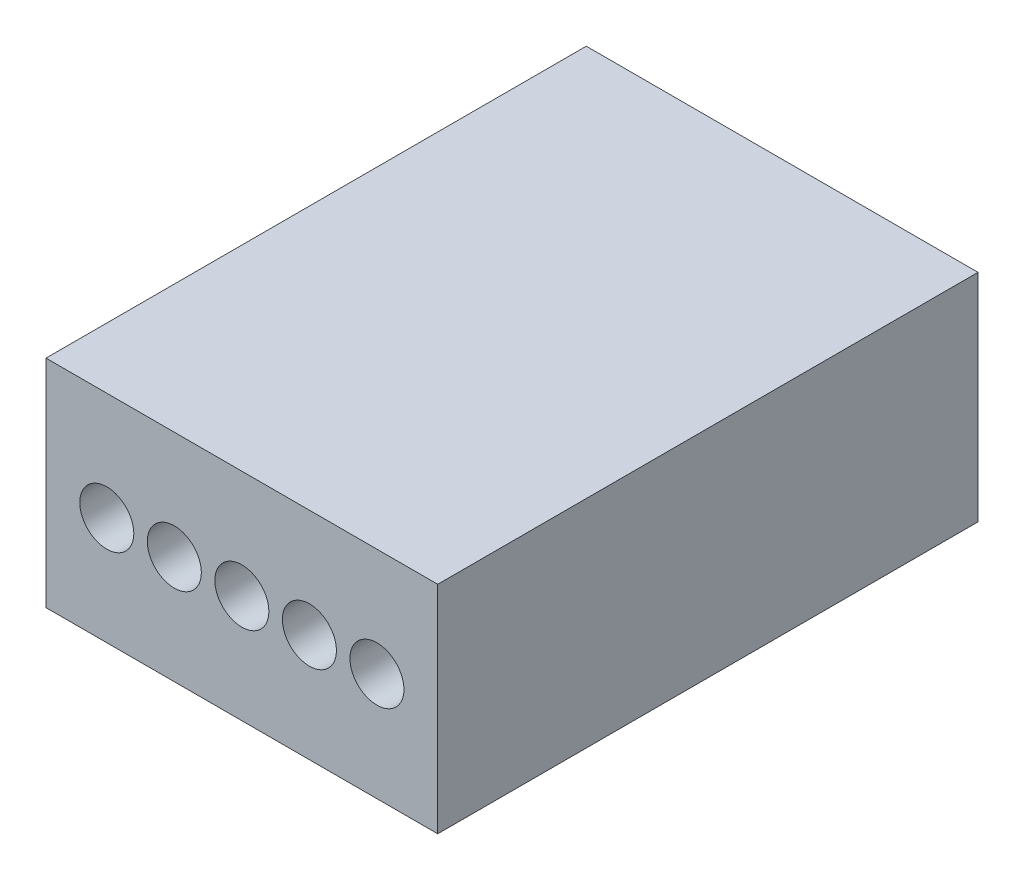
ISO-10303-21;
HEADER;
FILE_DESCRIPTION(('STEP AP214'),'2;1');
FILE_NAME('part.step','',(''),(''),'','','');
FILE_SCHEMA(('AUTOMOTIVE_DESIGN { 1 0 10303 214 1 1 1 1 }'));
ENDSEC;
DATA;
#1=APPLICATION_CONTEXT('core data for automotive mechanical design processes');
#2=APPLICATION_PROTOCOL_DEFINITION('international standard','automotive_design',2000,#1);
#3=PRODUCT_CONTEXT('',#1,'mechanical');
#4=PRODUCT('Part','Part','',(#3));
#5=PRODUCT_RELATED_PRODUCT_CATEGORY('part','',(#4));
#6=PRODUCT_DEFINITION_FORMATION('','',#4);
#7=PRODUCT_DEFINITION_CONTEXT('part definition',#1,'design');
#8=PRODUCT_DEFINITION('design','',#6,#7);
#9=PRODUCT_DEFINITION_SHAPE('','',#8);
#10=(LENGTH_UNIT() NAMED_UNIT(*) SI_UNIT(.MILLI.,.METRE.));
#11=(NAMED_UNIT(*) PLANE_ANGLE_UNIT() SI_UNIT($,.RADIAN.));
#12=(NAMED_UNIT(*) SI_UNIT($,.STERADIAN.) SOLID_ANGLE_UNIT());
#13=UNCERTAINTY_MEASURE_WITH_UNIT(LENGTH_MEASURE(1.E-05),#10,'distance_accuracy_value','');
#14=(GEOMETRIC_REPRESENTATION_CONTEXT(3) GLOBAL_UNCERTAINTY_ASSIGNED_CONTEXT((#13)) GLOBAL_UNIT_ASSIGNED_CONTEXT((#10,
#11,#12)) REPRESENTATION_CONTEXT('',''));
#15=CARTESIAN_POINT('',(0.,0.,0.));
#16=DIRECTION('',(0.,0.,1.));
#17=DIRECTION('',(1.,0.,0.));
#18=AXIS2_PLACEMENT_3D('',#15,#16,#17);
#19=CARTESIAN_POINT('',(0.,0.,10.));
#20=DIRECTION('',(1.,0.,0.));
#21=DIRECTION('',(0.,0.,-1.));
#22=AXIS2_PLACEMENT_3D('',#19,#20,#21);
#23=PLANE('',#22);
#24=DIRECTION('',(0.,-1.,0.));
#25=VECTOR('',#24,1.);
#26=CARTESIAN_POINT('',(0.,0.,0.));
#27=LINE('',#26,#25);
#28=CARTESIAN_POINT('',(0.,4.,0.));
#29=VERTEX_POINT('',#28);
#30=CARTESIAN_POINT('',(0.,0.,0.));
#31=VERTEX_POINT('',#30);
#32=EDGE_CURVE('E99',#29,#31,#27,.T.);
#33=ORIENTED_EDGE('',*,*,#32,.T.);
#34=DIRECTION('',(0.,0.,-1.));
#35=VECTOR('',#34,1.);
#36=CARTESIAN_POINT('',(0.,0.,10.));
#37=LINE('',#36,#35);
#38=CARTESIAN_POINT('',(0.,0.,10.));
#39=VERTEX_POINT('',#38);
#40=EDGE_CURVE('E11',#39,#31,#37,.T.);
#41=ORIENTED_EDGE('',*,*,#40,.F.);
#42=DIRECTION('',(0.,-1.,0.));
#43=VECTOR('',#42,1.);
#44=CARTESIAN_POINT('',(0.,0.,10.));
#45=LINE('',#44,#43);
#46=CARTESIAN_POINT('',(0.,4.,10.));
#47=VERTEX_POINT('',#46);
#48=EDGE_CURVE('E87',#47,#39,#45,.T.);
#49=ORIENTED_EDGE('',*,*,#48,.F.);
#50=DIRECTION('',(0.,0.,-1.));
#51=VECTOR('',#50,1.);
#52=CARTESIAN_POINT('',(0.,4.,10.));
#53=LINE('',#52,#51);
#54=EDGE_CURVE('E95',#47,#29,#53,.T.);
#55=ORIENTED_EDGE('',*,*,#54,.T.);
#56=EDGE_LOOP('',(#33,#41,#49,#55));
#57=FACE_BOUND('',#56,.T.);
#58=ADVANCED_FACE('F36',(#57),#23,.F.);
#59=CARTESIAN_POINT('',(0.,0.,10.));
#60=DIRECTION('',(0.,1.,0.));
#61=DIRECTION('',(0.,0.,1.));
#62=AXIS2_PLACEMENT_3D('',#59,#60,#61);
#63=PLANE('',#62);
#64=DIRECTION('',(1.,0.,0.));
#65=VECTOR('',#64,1.);
#66=CARTESIAN_POINT('',(0.,0.,0.));
#67=LINE('',#66,#65);
#68=CARTESIAN_POINT('',(7.25,0.,0.));
#69=VERTEX_POINT('',#68);
#70=EDGE_CURVE('E91',#31,#69,#67,.T.);
#71=ORIENTED_EDGE('',*,*,#70,.T.);
#72=DIRECTION('',(0.,0.,-1.));
#73=VECTOR('',#72,1.);
#74=CARTESIAN_POINT('',(7.25,0.,10.));
#75=LINE('',#74,#73);
#76=CARTESIAN_POINT('',(7.25,0.,10.));
#77=VERTEX_POINT('',#76);
#78=EDGE_CURVE('E44',#77,#69,#75,.T.);
#79=ORIENTED_EDGE('',*,*,#78,.F.);
#80=DIRECTION('',(1.,0.,0.));
#81=VECTOR('',#80,1.);
#82=CARTESIAN_POINT('',(0.,0.,10.));
#83=LINE('',#82,#81);
#84=EDGE_CURVE('E82',#39,#77,#83,.T.);
#85=ORIENTED_EDGE('',*,*,#84,.F.);
#86=ORIENTED_EDGE('',*,*,#40,.T.);
#87=EDGE_LOOP('',(#71,#79,#85,#86));
#88=FACE_BOUND('',#87,.T.);
#89=ADVANCED_FACE('F90',(#88),#63,.F.);
#90=CARTESIAN_POINT('',(7.25,0.,10.));
#91=DIRECTION('',(-1.,0.,0.));
#92=DIRECTION('',(0.,0.,1.));
#93=AXIS2_PLACEMENT_3D('',#90,#91,#92);
#94=PLANE('',#93);
#95=DIRECTION('',(0.,1.,0.));
#96=VECTOR('',#95,1.);
#97=CARTESIAN_POINT('',(7.25,0.,0.));
#98=LINE('',#97,#96);
#99=CARTESIAN_POINT('',(7.25,4.,0.));
#100=VERTEX_POINT('',#99);
#101=EDGE_CURVE('E69',#69,#100,#98,.T.);
#102=ORIENTED_EDGE('',*,*,#101,.T.);
#103=DIRECTION('',(0.,0.,-1.));
#104=VECTOR('',#103,1.);
#105=CARTESIAN_POINT('',(7.25,4.,10.));
#106=LINE('',#105,#104);
#107=CARTESIAN_POINT('',(7.25,4.,10.));
#108=VERTEX_POINT('',#107);
#109=EDGE_CURVE('E92',#108,#100,#106,.T.);
#110=ORIENTED_EDGE('',*,*,#109,.F.);
#111=DIRECTION('',(0.,1.,0.));
#112=VECTOR('',#111,1.);
#113=CARTESIAN_POINT('',(7.25,0.,10.));
#114=LINE('',#113,#112);
#115=EDGE_CURVE('E85',#77,#108,#114,.T.);
#116=ORIENTED_EDGE('',*,*,#115,.F.);
#117=ORIENTED_EDGE('',*,*,#78,.T.);
#118=EDGE_LOOP('',(#102,#110,#116,#117));
#119=FACE_BOUND('',#118,.T.);
#120=ADVANCED_FACE('F93',(#119),#94,.F.);
#121=CARTESIAN_POINT('',(0.,4.,10.));
#122=DIRECTION('',(0.,-1.,0.));
#123=DIRECTION('',(0.,0.,-1.));
#124=AXIS2_PLACEMENT_3D('',#121,#122,#123);
#125=PLANE('',#124);
#126=DIRECTION('',(-1.,0.,0.));
#127=VECTOR('',#126,1.);
#128=CARTESIAN_POINT('',(0.,4.,0.));
#129=LINE('',#128,#127);
#130=EDGE_CURVE('E75',#100,#29,#129,.T.);
#131=ORIENTED_EDGE('',*,*,#130,.T.);
#132=ORIENTED_EDGE('',*,*,#54,.F.);
#133=DIRECTION('',(-1.,0.,0.));
#134=VECTOR('',#133,1.);
#135=CARTESIAN_POINT('',(0.,4.,10.));
#136=LINE('',#135,#134);
#137=EDGE_CURVE('E52',#108,#47,#136,.T.);
#138=ORIENTED_EDGE('',*,*,#137,.F.);
#139=ORIENTED_EDGE('',*,*,#109,.T.);
#140=EDGE_LOOP('',(#131,#132,#138,#139));
#141=FACE_BOUND('',#140,.T.);
#142=ADVANCED_FACE('F107',(#141),#125,.F.);
#143=CARTESIAN_POINT('',(0.,0.,10.));
#144=DIRECTION('',(0.,0.,-1.));
#145=DIRECTION('',(-1.,0.,0.));
#146=AXIS2_PLACEMENT_3D('',#143,#144,#145);
#147=PLANE('',#146);
#148=CARTESIAN_POINT('',(1.125,2.,10.));
#149=DIRECTION('',(0.,0.,1.));
#150=DIRECTION('',(1.,0.,0.));
#151=AXIS2_PLACEMENT_3D('',#148,#149,#150);
#152=CIRCLE('',#151,0.5);
#153=CARTESIAN_POINT('',(1.625,2.,10.));
#154=VERTEX_POINT('',#153);
#155=EDGE_CURVE('E137',#154,#154,#152,.T.);
#156=ORIENTED_EDGE('',*,*,#155,.F.);
#157=EDGE_LOOP('',(#156));
#158=FACE_BOUND('',#157,.T.);
#159=CARTESIAN_POINT('',(2.375,2.,10.));
#160=DIRECTION('',(0.,0.,1.));
#161=DIRECTION('',(1.,0.,0.));
#162=AXIS2_PLACEMENT_3D('',#159,#160,#161);
#163=CIRCLE('',#162,0.5);
#164=CARTESIAN_POINT('',(2.875,2.,10.));
#165=VERTEX_POINT('',#164);
#166=EDGE_CURVE('E131',#165,#165,#163,.T.);
#167=ORIENTED_EDGE('',*,*,#166,.F.);
#168=EDGE_LOOP('',(#167));
#169=FACE_BOUND('',#168,.T.);
#170=CARTESIAN_POINT('',(3.625,2.,10.));
#171=DIRECTION('',(0.,0.,1.));
#172=DIRECTION('',(1.,0.,0.));
#173=AXIS2_PLACEMENT_3D('',#170,#171,#172);
#174=CIRCLE('',#173,0.5);
#175=CARTESIAN_POINT('',(4.125,2.,10.));
#176=VERTEX_POINT('',#175);
#177=EDGE_CURVE('E125',#176,#176,#174,.T.);
#178=ORIENTED_EDGE('',*,*,#177,.F.);
#179=EDGE_LOOP('',(#178));
#180=FACE_BOUND('',#179,.T.);
#181=CARTESIAN_POINT('',(4.875,2.,10.));
#182=DIRECTION('',(0.,0.,1.));
#183=DIRECTION('',(1.,0.,0.));
#184=AXIS2_PLACEMENT_3D('',#181,#182,#183);
#185=CIRCLE('',#184,0.5);
#186=CARTESIAN_POINT('',(5.375,2.,10.));
#187=VERTEX_POINT('',#186);
#188=EDGE_CURVE('E119',#187,#187,#185,.T.);
#189=ORIENTED_EDGE('',*,*,#188,.F.);
#190=EDGE_LOOP('',(#189));
#191=FACE_BOUND('',#190,.T.);
#192=CARTESIAN_POINT('',(6.125,2.,10.));
#193=DIRECTION('',(0.,0.,1.));
#194=DIRECTION('',(1.,0.,0.));
#195=AXIS2_PLACEMENT_3D('',#192,#193,#194);
#196=CIRCLE('',#195,0.5);
#197=CARTESIAN_POINT('',(6.625,2.,10.));
#198=VERTEX_POINT('',#197);
#199=EDGE_CURVE('E113',#198,#198,#196,.T.);
#200=ORIENTED_EDGE('',*,*,#199,.F.);
#201=EDGE_LOOP('',(#200));
#202=FACE_BOUND('',#201,.T.);
#203=ORIENTED_EDGE('',*,*,#48,.T.);
#204=ORIENTED_EDGE('',*,*,#84,.T.);
#205=ORIENTED_EDGE('',*,*,#115,.T.);
#206=ORIENTED_EDGE('',*,*,#137,.T.);
#207=EDGE_LOOP('',(#203,#204,#205,#206));
#208=FACE_BOUND('',#207,.T.);
#209=ADVANCED_FACE('F83',(#158,#169,#180,#191,#202,#208),#147,.F.);
#210=CARTESIAN_POINT('',(0.,0.,0.));
#211=DIRECTION('',(0.,0.,-1.));
#212=DIRECTION('',(-1.,0.,0.));
#213=AXIS2_PLACEMENT_3D('',#210,#211,#212);
#214=PLANE('',#213);
#215=ORIENTED_EDGE('',*,*,#32,.F.);
#216=ORIENTED_EDGE('',*,*,#130,.F.);
#217=ORIENTED_EDGE('',*,*,#101,.F.);
#218=ORIENTED_EDGE('',*,*,#70,.F.);
#219=EDGE_LOOP('',(#215,#216,#217,#218));
#220=FACE_BOUND('',#219,.T.);
#221=ADVANCED_FACE('F110',(#220),#214,.T.);
#222=CARTESIAN_POINT('',(6.125,2.,5.));
#223=DIRECTION('',(0.,0.,1.));
#224=DIRECTION('',(1.,0.,0.));
#225=AXIS2_PLACEMENT_3D('',#222,#223,#224);
#226=CYLINDRICAL_SURFACE('',#225,0.5);
#227=CARTESIAN_POINT('',(6.125,2.,5.));
#228=DIRECTION('',(0.,0.,1.));
#229=DIRECTION('',(1.,0.,0.));
#230=AXIS2_PLACEMENT_3D('',#227,#228,#229);
#231=CIRCLE('',#230,0.5);
#232=CARTESIAN_POINT('',(6.625,2.,5.));
#233=VERTEX_POINT('',#232);
#234=EDGE_CURVE('E116',#233,#233,#231,.T.);
#235=ORIENTED_EDGE('',*,*,#234,.F.);
#236=EDGE_LOOP('',(#235));
#237=FACE_BOUND('',#236,.T.);
#238=ORIENTED_EDGE('',*,*,#199,.T.);
#239=EDGE_LOOP('',(#238));
#240=FACE_BOUND('',#239,.T.);
#241=ADVANCED_FACE('F163',(#237,#240),#226,.F.);
#242=CARTESIAN_POINT('',(6.125,2.,5.));
#243=DIRECTION('',(0.,0.,1.));
#244=DIRECTION('',(1.,0.,0.));
#245=AXIS2_PLACEMENT_3D('',#242,#243,#244);
#246=PLANE('',#245);
#247=ORIENTED_EDGE('',*,*,#234,.T.);
#248=EDGE_LOOP('',(#247));
#249=FACE_BOUND('',#248,.T.);
#250=ADVANCED_FACE('F165',(#249),#246,.T.);
#251=CARTESIAN_POINT('',(4.875,2.,5.));
#252=DIRECTION('',(0.,0.,1.));
#253=DIRECTION('',(1.,0.,0.));
#254=AXIS2_PLACEMENT_3D('',#251,#252,#253);
#255=CYLINDRICAL_SURFACE('',#254,0.5);
#256=CARTESIAN_POINT('',(4.875,2.,5.));
#257=DIRECTION('',(0.,0.,1.));
#258=DIRECTION('',(1.,0.,0.));
#259=AXIS2_PLACEMENT_3D('',#256,#257,#258);
#260=CIRCLE('',#259,0.5);
#261=CARTESIAN_POINT('',(5.375,2.,5.));
#262=VERTEX_POINT('',#261);
#263=EDGE_CURVE('E122',#262,#262,#260,.T.);
#264=ORIENTED_EDGE('',*,*,#263,.F.);
#265=EDGE_LOOP('',(#264));
#266=FACE_BOUND('',#265,.T.);
#267=ORIENTED_EDGE('',*,*,#188,.T.);
#268=EDGE_LOOP('',(#267));
#269=FACE_BOUND('',#268,.T.);
#270=ADVANCED_FACE('F172',(#266,#269),#255,.F.);
#271=CARTESIAN_POINT('',(4.875,2.,5.));
#272=DIRECTION('',(0.,0.,1.));
#273=DIRECTION('',(1.,0.,0.));
#274=AXIS2_PLACEMENT_3D('',#271,#272,#273);
#275=PLANE('',#274);
#276=ORIENTED_EDGE('',*,*,#263,.T.);
#277=EDGE_LOOP('',(#276));
#278=FACE_BOUND('',#277,.T.);
#279=ADVANCED_FACE('F220',(#278),#275,.T.);
#280=CARTESIAN_POINT('',(3.625,2.,5.));
#281=DIRECTION('',(0.,0.,1.));
#282=DIRECTION('',(1.,0.,0.));
#283=AXIS2_PLACEMENT_3D('',#280,#281,#282);
#284=CYLINDRICAL_SURFACE('',#283,0.5);
#285=CARTESIAN_POINT('',(3.625,2.,5.));
#286=DIRECTION('',(0.,0.,1.));
#287=DIRECTION('',(1.,0.,0.));
#288=AXIS2_PLACEMENT_3D('',#285,#286,#287);
#289=CIRCLE('',#288,0.5);
#290=CARTESIAN_POINT('',(4.125,2.,5.));
#291=VERTEX_POINT('',#290);
#292=EDGE_CURVE('E128',#291,#291,#289,.T.);
#293=ORIENTED_EDGE('',*,*,#292,.F.);
#294=EDGE_LOOP('',(#293));
#295=FACE_BOUND('',#294,.T.);
#296=ORIENTED_EDGE('',*,*,#177,.T.);
#297=EDGE_LOOP('',(#296));
#298=FACE_BOUND('',#297,.T.);
#299=ADVANCED_FACE('F229',(#295,#298),#284,.F.);
#300=CARTESIAN_POINT('',(3.625,2.,5.));
#301=DIRECTION('',(0.,0.,1.));
#302=DIRECTION('',(1.,0.,0.));
#303=AXIS2_PLACEMENT_3D('',#300,#301,#302);
#304=PLANE('',#303);
#305=ORIENTED_EDGE('',*,*,#292,.T.);
#306=EDGE_LOOP('',(#305));
#307=FACE_BOUND('',#306,.T.);
#308=ADVANCED_FACE('F238',(#307),#304,.T.);
#309=CARTESIAN_POINT('',(2.375,2.,5.));
#310=DIRECTION('',(0.,0.,1.));
#311=DIRECTION('',(1.,0.,0.));
#312=AXIS2_PLACEMENT_3D('',#309,#310,#311);
#313=CYLINDRICAL_SURFACE('',#312,0.5);
#314=CARTESIAN_POINT('',(2.375,2.,5.));
#315=DIRECTION('',(0.,0.,1.));
#316=DIRECTION('',(1.,0.,0.));
#317=AXIS2_PLACEMENT_3D('',#314,#315,#316);
#318=CIRCLE('',#317,0.5);
#319=CARTESIAN_POINT('',(2.875,2.,5.));
#320=VERTEX_POINT('',#319);
#321=EDGE_CURVE('E134',#320,#320,#318,.T.);
#322=ORIENTED_EDGE('',*,*,#321,.F.);
#323=EDGE_LOOP('',(#322));
#324=FACE_BOUND('',#323,.T.);
#325=ORIENTED_EDGE('',*,*,#166,.T.);
#326=EDGE_LOOP('',(#325));
#327=FACE_BOUND('',#326,.T.);
#328=ADVANCED_FACE('F247',(#324,#327),#313,.F.);
#329=CARTESIAN_POINT('',(2.375,2.,5.));
#330=DIRECTION('',(0.,0.,1.));
#331=DIRECTION('',(1.,0.,0.));
#332=AXIS2_PLACEMENT_3D('',#329,#330,#331);
#333=PLANE('',#332);
#334=ORIENTED_EDGE('',*,*,#321,.T.);
#335=EDGE_LOOP('',(#334));
#336=FACE_BOUND('',#335,.T.);
#337=ADVANCED_FACE('F148',(#336),#333,.T.);
#338=CARTESIAN_POINT('',(1.125,2.,5.));
#339=DIRECTION('',(0.,0.,1.));
#340=DIRECTION('',(1.,0.,0.));
#341=AXIS2_PLACEMENT_3D('',#338,#339,#340);
#342=CYLINDRICAL_SURFACE('',#341,0.5);
#343=CARTESIAN_POINT('',(1.125,2.,5.));
#344=DIRECTION('',(0.,0.,1.));
#345=DIRECTION('',(1.,0.,0.));
#346=AXIS2_PLACEMENT_3D('',#343,#344,#345);
#347=CIRCLE('',#346,0.5);
#348=CARTESIAN_POINT('',(1.625,2.,5.));
#349=VERTEX_POINT('',#348);
#350=EDGE_CURVE('E102',#349,#349,#347,.T.);
#351=ORIENTED_EDGE('',*,*,#350,.F.);
#352=EDGE_LOOP('',(#351));
#353=FACE_BOUND('',#352,.T.);
#354=ORIENTED_EDGE('',*,*,#155,.T.);
#355=EDGE_LOOP('',(#354));
#356=FACE_BOUND('',#355,.T.);
#357=ADVANCED_FACE('F145',(#353,#356),#342,.F.);
#358=CARTESIAN_POINT('',(1.125,2.,5.));
#359=DIRECTION('',(0.,0.,1.));
#360=DIRECTION('',(1.,0.,0.));
#361=AXIS2_PLACEMENT_3D('',#358,#359,#360);
#362=PLANE('',#361);
#363=ORIENTED_EDGE('',*,*,#350,.T.);
#364=EDGE_LOOP('',(#363));
#365=FACE_BOUND('',#364,.T.);
#366=ADVANCED_FACE('F143',(#365),#362,.T.);
#367=CLOSED_SHELL('',(#58,#89,#120,#142,#209,#221,#241,#250,#270,#279,#299,#308,#328,#337,#357,#366));
#368=MANIFOLD_SOLID_BREP('B2',#367);
#369=ADVANCED_BREP_SHAPE_REPRESENTATION('',(#18,#368),#14);
#370=SHAPE_DEFINITION_REPRESENTATION(#9,#369);
ENDSEC;
END-ISO-10303-21;
